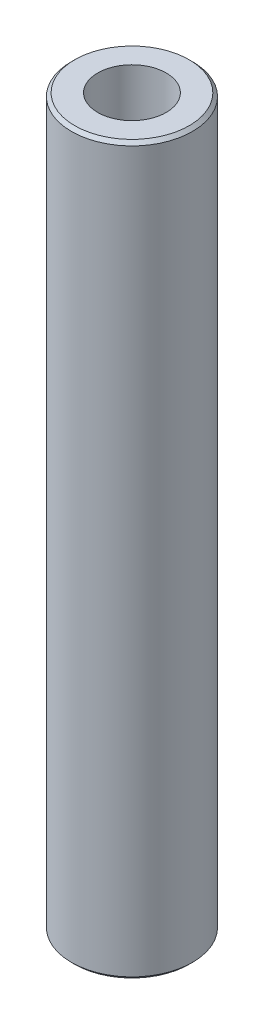
ISO-10303-21;
HEADER;
FILE_DESCRIPTION(('STEP AP214'),'2;1');
FILE_NAME('part.step','',(''),(''),'','','');
FILE_SCHEMA(('AUTOMOTIVE_DESIGN { 1 0 10303 214 1 1 1 1 }'));
ENDSEC;
DATA;
#1=APPLICATION_CONTEXT('core data for automotive mechanical design processes');
#2=APPLICATION_PROTOCOL_DEFINITION('international standard','automotive_design',2000,#1);
#3=PRODUCT_CONTEXT('',#1,'mechanical');
#4=PRODUCT('Part','Part','',(#3));
#5=PRODUCT_RELATED_PRODUCT_CATEGORY('part','',(#4));
#6=PRODUCT_DEFINITION_FORMATION('','',#4);
#7=PRODUCT_DEFINITION_CONTEXT('part definition',#1,'design');
#8=PRODUCT_DEFINITION('design','',#6,#7);
#9=PRODUCT_DEFINITION_SHAPE('','',#8);
#10=(LENGTH_UNIT() NAMED_UNIT(*) SI_UNIT(.MILLI.,.METRE.));
#11=(NAMED_UNIT(*) PLANE_ANGLE_UNIT() SI_UNIT($,.RADIAN.));
#12=(NAMED_UNIT(*) SI_UNIT($,.STERADIAN.) SOLID_ANGLE_UNIT());
#13=UNCERTAINTY_MEASURE_WITH_UNIT(LENGTH_MEASURE(1.E-05),#10,'distance_accuracy_value','');
#14=(GEOMETRIC_REPRESENTATION_CONTEXT(3) GLOBAL_UNCERTAINTY_ASSIGNED_CONTEXT((#13)) GLOBAL_UNIT_ASSIGNED_CONTEXT((#10,
#11,#12)) REPRESENTATION_CONTEXT('',''));
#15=CARTESIAN_POINT('',(0.,0.,0.));
#16=DIRECTION('',(0.,0.,1.));
#17=DIRECTION('',(1.,0.,0.));
#18=AXIS2_PLACEMENT_3D('',#15,#16,#17);
#19=CARTESIAN_POINT('',(0.,600.,0.));
#20=DIRECTION('',(0.,-1.,0.));
#21=DIRECTION('',(0.,0.,-1.));
#22=AXIS2_PLACEMENT_3D('',#19,#20,#21);
#23=CYLINDRICAL_SURFACE('',#22,50.);
#24=CARTESIAN_POINT('',(0.,597.258655730998,0.));
#25=DIRECTION('',(0.,1.,0.));
#26=DIRECTION('',(0.,0.,1.));
#27=AXIS2_PLACEMENT_3D('',#24,#25,#26);
#28=CIRCLE('',#27,50.);
#29=CARTESIAN_POINT('',(0.,597.258655730998,50.));
#30=VERTEX_POINT('',#29);
#31=EDGE_CURVE('E50',#30,#30,#28,.F.);
#32=ORIENTED_EDGE('',*,*,#31,.T.);
#33=EDGE_LOOP('',(#32));
#34=FACE_BOUND('',#33,.T.);
#35=CARTESIAN_POINT('',(0.,2.7413442690023,0.));
#36=DIRECTION('',(0.,1.,0.));
#37=DIRECTION('',(0.,0.,1.));
#38=AXIS2_PLACEMENT_3D('',#35,#36,#37);
#39=CIRCLE('',#38,50.);
#40=CARTESIAN_POINT('',(0.,2.7413442690023,50.));
#41=VERTEX_POINT('',#40);
#42=EDGE_CURVE('E51',#41,#41,#39,.T.);
#43=ORIENTED_EDGE('',*,*,#42,.T.);
#44=EDGE_LOOP('',(#43));
#45=FACE_BOUND('',#44,.T.);
#46=ADVANCED_FACE('F39',(#34,#45),#23,.T.);
#47=CARTESIAN_POINT('',(0.,600.,0.));
#48=DIRECTION('',(0.,1.,0.));
#49=DIRECTION('',(0.,0.,1.));
#50=AXIS2_PLACEMENT_3D('',#47,#48,#49);
#51=PLANE('',#50);
#52=CARTESIAN_POINT('',(0.,600.,0.));
#53=DIRECTION('',(0.,1.,0.));
#54=DIRECTION('',(0.,0.,1.));
#55=AXIS2_PLACEMENT_3D('',#52,#53,#54);
#56=CIRCLE('',#55,47.2586557309976);
#57=CARTESIAN_POINT('',(0.,600.,47.2586557309976));
#58=VERTEX_POINT('',#57);
#59=EDGE_CURVE('E54',#58,#58,#56,.T.);
#60=ORIENTED_EDGE('',*,*,#59,.T.);
#61=EDGE_LOOP('',(#60));
#62=FACE_BOUND('',#61,.T.);
#63=CARTESIAN_POINT('',(0.,600.,0.));
#64=DIRECTION('',(0.,1.,0.));
#65=DIRECTION('',(0.,0.,1.));
#66=AXIS2_PLACEMENT_3D('',#63,#64,#65);
#67=CIRCLE('',#66,28.301035695562);
#68=CARTESIAN_POINT('',(0.,600.,28.301035695562));
#69=VERTEX_POINT('',#68);
#70=EDGE_CURVE('E58',#69,#69,#67,.T.);
#71=ORIENTED_EDGE('',*,*,#70,.F.);
#72=EDGE_LOOP('',(#71));
#73=FACE_BOUND('',#72,.T.);
#74=ADVANCED_FACE('F69',(#62,#73),#51,.T.);
#75=CARTESIAN_POINT('',(0.,0.,0.));
#76=DIRECTION('',(0.,1.,0.));
#77=DIRECTION('',(0.,0.,1.));
#78=AXIS2_PLACEMENT_3D('',#75,#76,#77);
#79=PLANE('',#78);
#80=CARTESIAN_POINT('',(0.,0.,0.));
#81=DIRECTION('',(0.,1.,0.));
#82=DIRECTION('',(0.,0.,1.));
#83=AXIS2_PLACEMENT_3D('',#80,#81,#82);
#84=CIRCLE('',#83,47.2586557309977);
#85=CARTESIAN_POINT('',(0.,0.,47.2586557309977));
#86=VERTEX_POINT('',#85);
#87=EDGE_CURVE('E10',#86,#86,#84,.F.);
#88=ORIENTED_EDGE('',*,*,#87,.T.);
#89=EDGE_LOOP('',(#88));
#90=FACE_BOUND('',#89,.T.);
#91=CARTESIAN_POINT('',(0.,0.,0.));
#92=DIRECTION('',(0.,1.,0.));
#93=DIRECTION('',(0.,0.,1.));
#94=AXIS2_PLACEMENT_3D('',#91,#92,#93);
#95=CIRCLE('',#94,28.301035695562);
#96=CARTESIAN_POINT('',(0.,0.,28.301035695562));
#97=VERTEX_POINT('',#96);
#98=EDGE_CURVE('E63',#97,#97,#95,.T.);
#99=ORIENTED_EDGE('',*,*,#98,.T.);
#100=EDGE_LOOP('',(#99));
#101=FACE_BOUND('',#100,.T.);
#102=ADVANCED_FACE('F75',(#90,#101),#79,.F.);
#103=CARTESIAN_POINT('',(0.,600.,0.));
#104=DIRECTION('',(0.,-1.,0.));
#105=DIRECTION('',(0.,0.,-1.));
#106=AXIS2_PLACEMENT_3D('',#103,#104,#105);
#107=CYLINDRICAL_SURFACE('',#106,28.301035695562);
#108=ORIENTED_EDGE('',*,*,#70,.T.);
#109=EDGE_LOOP('',(#108));
#110=FACE_BOUND('',#109,.T.);
#111=ORIENTED_EDGE('',*,*,#98,.F.);
#112=EDGE_LOOP('',(#111));
#113=FACE_BOUND('',#112,.T.);
#114=ADVANCED_FACE('F70',(#110,#113),#107,.F.);
#115=CARTESIAN_POINT('',(0.,600.,0.));
#116=DIRECTION('',(0.,-1.,0.));
#117=DIRECTION('',(0.,0.,-1.));
#118=AXIS2_PLACEMENT_3D('',#115,#116,#117);
#119=CONICAL_SURFACE('',#118,47.2586557309976,0.785398163397451);
#120=ORIENTED_EDGE('',*,*,#31,.F.);
#121=EDGE_LOOP('',(#120));
#122=FACE_BOUND('',#121,.T.);
#123=ORIENTED_EDGE('',*,*,#59,.F.);
#124=EDGE_LOOP('',(#123));
#125=FACE_BOUND('',#124,.T.);
#126=ADVANCED_FACE('F81',(#122,#125),#119,.T.);
#127=CARTESIAN_POINT('',(0.,2.7413442690023,0.));
#128=DIRECTION('',(0.,1.,0.));
#129=DIRECTION('',(0.,0.,1.));
#130=AXIS2_PLACEMENT_3D('',#127,#128,#129);
#131=CONICAL_SURFACE('',#130,50.,0.78539816339745);
#132=ORIENTED_EDGE('',*,*,#87,.F.);
#133=EDGE_LOOP('',(#132));
#134=FACE_BOUND('',#133,.T.);
#135=ORIENTED_EDGE('',*,*,#42,.F.);
#136=EDGE_LOOP('',(#135));
#137=FACE_BOUND('',#136,.T.);
#138=ADVANCED_FACE('F45',(#134,#137),#131,.T.);
#139=CLOSED_SHELL('',(#46,#74,#102,#114,#126,#138));
#140=MANIFOLD_SOLID_BREP('B2',#139);
#141=ADVANCED_BREP_SHAPE_REPRESENTATION('',(#18,#140),#14);
#142=SHAPE_DEFINITION_REPRESENTATION(#9,#141);
ENDSEC;
END-ISO-10303-21;
